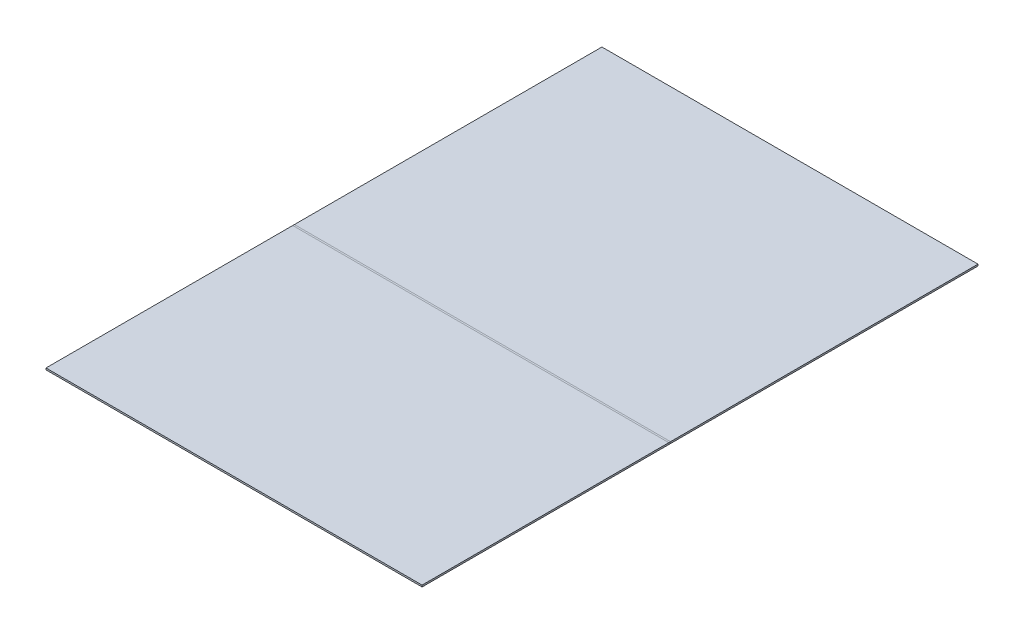
ISO-10303-21;
HEADER;
FILE_DESCRIPTION(('STEP AP214'),'2;1');
FILE_NAME('part.step','',(''),(''),'','','');
FILE_SCHEMA(('AUTOMOTIVE_DESIGN { 1 0 10303 214 1 1 1 1 }'));
ENDSEC;
DATA;
#1=APPLICATION_CONTEXT('core data for automotive mechanical design processes');
#2=APPLICATION_PROTOCOL_DEFINITION('international standard','automotive_design',2000,#1);
#3=PRODUCT_CONTEXT('',#1,'mechanical');
#4=PRODUCT('Part','Part','',(#3));
#5=PRODUCT_RELATED_PRODUCT_CATEGORY('part','',(#4));
#6=PRODUCT_DEFINITION_FORMATION('','',#4);
#7=PRODUCT_DEFINITION_CONTEXT('part definition',#1,'design');
#8=PRODUCT_DEFINITION('design','',#6,#7);
#9=PRODUCT_DEFINITION_SHAPE('','',#8);
#10=(LENGTH_UNIT() NAMED_UNIT(*) SI_UNIT(.MILLI.,.METRE.));
#11=(NAMED_UNIT(*) PLANE_ANGLE_UNIT() SI_UNIT($,.RADIAN.));
#12=(NAMED_UNIT(*) SI_UNIT($,.STERADIAN.) SOLID_ANGLE_UNIT());
#13=UNCERTAINTY_MEASURE_WITH_UNIT(LENGTH_MEASURE(1.E-05),#10,'distance_accuracy_value','');
#14=(GEOMETRIC_REPRESENTATION_CONTEXT(3) GLOBAL_UNCERTAINTY_ASSIGNED_CONTEXT((#13)) GLOBAL_UNIT_ASSIGNED_CONTEXT((#10,
#11,#12)) REPRESENTATION_CONTEXT('',''));
#15=CARTESIAN_POINT('',(0.,0.,0.));
#16=DIRECTION('',(0.,0.,1.));
#17=DIRECTION('',(1.,0.,0.));
#18=AXIS2_PLACEMENT_3D('',#15,#16,#17);
#19=CARTESIAN_POINT('',(0.,1.9557999999999,291.722844699422));
#20=DIRECTION('',(1.,0.,0.));
#21=DIRECTION('',(0.,0.86602540378444,-0.499999999999997));
#22=AXIS2_PLACEMENT_3D('',#19,#20,#21);
#23=PLANE('',#22);
#24=DIRECTION('',(0.,0.,1.));
#25=VECTOR('',#24,1.);
#26=CARTESIAN_POINT('',(0.,0.,291.018939251226));
#27=LINE('',#26,#25);
#28=CARTESIAN_POINT('',(0.,0.,292.36075901185));
#29=VERTEX_POINT('',#28);
#30=CARTESIAN_POINT('',(0.,-3.88578058618805E-13,525.65408864989));
#31=VERTEX_POINT('',#30);
#32=EDGE_CURVE('E66',#29,#31,#27,.T.);
#33=ORIENTED_EDGE('',*,*,#32,.F.);
#34=DIRECTION('',(0.,1.,0.));
#35=VECTOR('',#34,1.);
#36=CARTESIAN_POINT('',(0.,0.,292.36075901185));
#37=LINE('',#36,#35);
#38=CARTESIAN_POINT('',(0.,1.58749999999996,292.36075901185));
#39=VERTEX_POINT('',#38);
#40=EDGE_CURVE('E11',#29,#39,#37,.T.);
#41=ORIENTED_EDGE('',*,*,#40,.T.);
#42=DIRECTION('',(0.,0.,1.));
#43=VECTOR('',#42,1.);
#44=CARTESIAN_POINT('',(0.,1.58749999999991,291.018939251226));
#45=LINE('',#44,#43);
#46=CARTESIAN_POINT('',(0.,1.58749999999958,525.65408864989));
#47=VERTEX_POINT('',#46);
#48=EDGE_CURVE('E109',#39,#47,#45,.T.);
#49=ORIENTED_EDGE('',*,*,#48,.T.);
#50=DIRECTION('',(0.,1.,0.));
#51=VECTOR('',#50,1.);
#52=CARTESIAN_POINT('',(0.,-3.88578058618805E-13,525.65408864989));
#53=LINE('',#52,#51);
#54=EDGE_CURVE('E103',#31,#47,#53,.T.);
#55=ORIENTED_EDGE('',*,*,#54,.F.);
#56=EDGE_LOOP('',(#33,#41,#49,#55));
#57=FACE_BOUND('',#56,.T.);
#58=ADVANCED_FACE('F37',(#57),#23,.T.);
#59=CARTESIAN_POINT('',(-355.6,1.58749999999991,291.018939251226));
#60=DIRECTION('',(0.,1.,0.));
#61=DIRECTION('',(0.,0.,1.));
#62=AXIS2_PLACEMENT_3D('',#59,#60,#61);
#63=PLANE('',#62);
#64=ORIENTED_EDGE('',*,*,#48,.F.);
#65=DIRECTION('',(1.,0.,0.));
#66=VECTOR('',#65,1.);
#67=CARTESIAN_POINT('',(-355.6,1.58749999999991,292.36075901185));
#68=LINE('',#67,#66);
#69=CARTESIAN_POINT('',(-355.6,1.58749999999996,292.36075901185));
#70=VERTEX_POINT('',#69);
#71=EDGE_CURVE('E45',#70,#39,#68,.T.);
#72=ORIENTED_EDGE('',*,*,#71,.F.);
#73=DIRECTION('',(0.,0.,1.));
#74=VECTOR('',#73,1.);
#75=CARTESIAN_POINT('',(-355.6,1.58749999999991,291.018939251226));
#76=LINE('',#75,#74);
#77=CARTESIAN_POINT('',(-355.6,1.58749999999958,525.65408864989));
#78=VERTEX_POINT('',#77);
#79=EDGE_CURVE('E104',#70,#78,#76,.T.);
#80=ORIENTED_EDGE('',*,*,#79,.T.);
#81=DIRECTION('',(1.,0.,0.));
#82=VECTOR('',#81,1.);
#83=CARTESIAN_POINT('',(-355.6,1.58749999999958,525.65408864989));
#84=LINE('',#83,#82);
#85=EDGE_CURVE('E114',#78,#47,#84,.T.);
#86=ORIENTED_EDGE('',*,*,#85,.T.);
#87=EDGE_LOOP('',(#64,#72,#80,#86));
#88=FACE_BOUND('',#87,.T.);
#89=ADVANCED_FACE('F129',(#88),#63,.T.);
#90=CARTESIAN_POINT('',(-355.6,0.,291.018939251226));
#91=DIRECTION('',(0.,1.,0.));
#92=DIRECTION('',(0.,0.,1.));
#93=AXIS2_PLACEMENT_3D('',#90,#91,#92);
#94=PLANE('',#93);
#95=ORIENTED_EDGE('',*,*,#32,.T.);
#96=DIRECTION('',(1.,0.,0.));
#97=VECTOR('',#96,1.);
#98=CARTESIAN_POINT('',(-355.6,-3.88578058618805E-13,525.65408864989));
#99=LINE('',#98,#97);
#100=CARTESIAN_POINT('',(-355.6,-3.88578058618805E-13,525.65408864989));
#101=VERTEX_POINT('',#100);
#102=EDGE_CURVE('E99',#101,#31,#99,.T.);
#103=ORIENTED_EDGE('',*,*,#102,.F.);
#104=DIRECTION('',(0.,0.,1.));
#105=VECTOR('',#104,1.);
#106=CARTESIAN_POINT('',(-355.6,0.,291.018939251226));
#107=LINE('',#106,#105);
#108=CARTESIAN_POINT('',(-355.6,0.,292.36075901185));
#109=VERTEX_POINT('',#108);
#110=EDGE_CURVE('E53',#109,#101,#107,.T.);
#111=ORIENTED_EDGE('',*,*,#110,.F.);
#112=DIRECTION('',(1.,0.,0.));
#113=VECTOR('',#112,1.);
#114=CARTESIAN_POINT('',(-355.6,0.,292.36075901185));
#115=LINE('',#114,#113);
#116=EDGE_CURVE('E78',#109,#29,#115,.T.);
#117=ORIENTED_EDGE('',*,*,#116,.T.);
#118=EDGE_LOOP('',(#95,#103,#111,#117));
#119=FACE_BOUND('',#118,.T.);
#120=ADVANCED_FACE('F97',(#119),#94,.F.);
#121=CARTESIAN_POINT('',(-355.6,-3.88578058618805E-13,525.65408864989));
#122=DIRECTION('',(0.,0.,-1.));
#123=DIRECTION('',(0.,1.,0.));
#124=AXIS2_PLACEMENT_3D('',#121,#122,#123);
#125=PLANE('',#124);
#126=ORIENTED_EDGE('',*,*,#54,.T.);
#127=ORIENTED_EDGE('',*,*,#85,.F.);
#128=DIRECTION('',(0.,1.,0.));
#129=VECTOR('',#128,1.);
#130=CARTESIAN_POINT('',(-355.6,-3.88578058618805E-13,525.65408864989));
#131=LINE('',#130,#129);
#132=EDGE_CURVE('E107',#101,#78,#131,.T.);
#133=ORIENTED_EDGE('',*,*,#132,.F.);
#134=ORIENTED_EDGE('',*,*,#102,.T.);
#135=EDGE_LOOP('',(#126,#127,#133,#134));
#136=FACE_BOUND('',#135,.T.);
#137=ADVANCED_FACE('F218',(#136),#125,.F.);
#138=CARTESIAN_POINT('',(-355.6,2.32409999999988,292.36075901185));
#139=DIRECTION('',(1.,0.,0.));
#140=DIRECTION('',(0.,0.86602540378444,-0.499999999999997));
#141=AXIS2_PLACEMENT_3D('',#138,#139,#140);
#142=PLANE('',#141);
#143=ORIENTED_EDGE('',*,*,#79,.F.);
#144=DIRECTION('',(0.,-1.,0.));
#145=VECTOR('',#144,1.);
#146=CARTESIAN_POINT('',(-355.6,1.58749999999991,292.36075901185));
#147=LINE('',#146,#145);
#148=EDGE_CURVE('E98',#70,#109,#147,.T.);
#149=ORIENTED_EDGE('',*,*,#148,.T.);
#150=ORIENTED_EDGE('',*,*,#110,.T.);
#151=ORIENTED_EDGE('',*,*,#132,.T.);
#152=EDGE_LOOP('',(#143,#149,#150,#151));
#153=FACE_BOUND('',#152,.T.);
#154=ADVANCED_FACE('F222',(#153),#142,.F.);
#155=CARTESIAN_POINT('',(-355.6,1.5875,0.));
#156=DIRECTION('',(0.,0.,1.));
#157=DIRECTION('',(0.,-1.,0.));
#158=AXIS2_PLACEMENT_3D('',#155,#156,#157);
#159=PLANE('',#158);
#160=DIRECTION('',(0.,-1.,0.));
#161=VECTOR('',#160,1.);
#162=CARTESIAN_POINT('',(0.,1.5875,0.));
#163=LINE('',#162,#161);
#164=CARTESIAN_POINT('',(0.,1.5875,0.));
#165=VERTEX_POINT('',#164);
#166=CARTESIAN_POINT('',(0.,0.,0.));
#167=VERTEX_POINT('',#166);
#168=EDGE_CURVE('E176',#165,#167,#163,.T.);
#169=ORIENTED_EDGE('',*,*,#168,.T.);
#170=DIRECTION('',(1.,0.,0.));
#171=VECTOR('',#170,1.);
#172=CARTESIAN_POINT('',(-355.6,0.,0.));
#173=LINE('',#172,#171);
#174=CARTESIAN_POINT('',(-355.6,0.,0.));
#175=VERTEX_POINT('',#174);
#176=EDGE_CURVE('E170',#175,#167,#173,.T.);
#177=ORIENTED_EDGE('',*,*,#176,.F.);
#178=DIRECTION('',(0.,-1.,0.));
#179=VECTOR('',#178,1.);
#180=CARTESIAN_POINT('',(-355.6,1.5875,0.));
#181=LINE('',#180,#179);
#182=CARTESIAN_POINT('',(-355.6,1.5875,0.));
#183=VERTEX_POINT('',#182);
#184=EDGE_CURVE('E160',#183,#175,#181,.T.);
#185=ORIENTED_EDGE('',*,*,#184,.F.);
#186=DIRECTION('',(1.,0.,0.));
#187=VECTOR('',#186,1.);
#188=CARTESIAN_POINT('',(-355.6,1.5875,0.));
#189=LINE('',#188,#187);
#190=EDGE_CURVE('E178',#183,#165,#189,.T.);
#191=ORIENTED_EDGE('',*,*,#190,.T.);
#192=EDGE_LOOP('',(#169,#177,#185,#191));
#193=FACE_BOUND('',#192,.T.);
#194=ADVANCED_FACE('F198',(#193),#159,.F.);
#195=CARTESIAN_POINT('',(-355.6,0.,0.));
#196=DIRECTION('',(0.,1.,0.));
#197=DIRECTION('',(0.,0.,1.));
#198=AXIS2_PLACEMENT_3D('',#195,#196,#197);
#199=PLANE('',#198);
#200=DIRECTION('',(0.,0.,1.));
#201=VECTOR('',#200,1.);
#202=CARTESIAN_POINT('',(0.,0.,0.));
#203=LINE('',#202,#201);
#204=CARTESIAN_POINT('',(0.,0.,290.758180239376));
#205=VERTEX_POINT('',#204);
#206=EDGE_CURVE('E174',#167,#205,#203,.T.);
#207=ORIENTED_EDGE('',*,*,#206,.T.);
#208=DIRECTION('',(1.,0.,0.));
#209=VECTOR('',#208,1.);
#210=CARTESIAN_POINT('',(-355.6,0.,290.758180239376));
#211=LINE('',#210,#209);
#212=CARTESIAN_POINT('',(-355.6,0.,290.758180239376));
#213=VERTEX_POINT('',#212);
#214=EDGE_CURVE('E82',#213,#205,#211,.T.);
#215=ORIENTED_EDGE('',*,*,#214,.F.);
#216=DIRECTION('',(0.,0.,1.));
#217=VECTOR('',#216,1.);
#218=CARTESIAN_POINT('',(-355.6,0.,0.));
#219=LINE('',#218,#217);
#220=EDGE_CURVE('E161',#175,#213,#219,.T.);
#221=ORIENTED_EDGE('',*,*,#220,.F.);
#222=ORIENTED_EDGE('',*,*,#176,.T.);
#223=EDGE_LOOP('',(#207,#215,#221,#222));
#224=FACE_BOUND('',#223,.T.);
#225=ADVANCED_FACE('F172',(#224),#199,.F.);
#226=CARTESIAN_POINT('',(-355.6,1.95579999999998,291.396094551804));
#227=DIRECTION('',(-1.,0.,0.));
#228=DIRECTION('',(0.,0.,1.));
#229=AXIS2_PLACEMENT_3D('',#226,#227,#228);
#230=PLANE('',#229);
#231=ORIENTED_EDGE('',*,*,#220,.T.);
#232=DIRECTION('',(0.,1.,0.));
#233=VECTOR('',#232,1.);
#234=CARTESIAN_POINT('',(-355.6,0.,290.758180239376));
#235=LINE('',#234,#233);
#236=CARTESIAN_POINT('',(-355.6,1.58749999999996,290.758180239376));
#237=VERTEX_POINT('',#236);
#238=EDGE_CURVE('E154',#213,#237,#235,.T.);
#239=ORIENTED_EDGE('',*,*,#238,.T.);
#240=DIRECTION('',(0.,0.,1.));
#241=VECTOR('',#240,1.);
#242=CARTESIAN_POINT('',(-355.6,1.5875,0.));
#243=LINE('',#242,#241);
#244=EDGE_CURVE('E192',#183,#237,#243,.T.);
#245=ORIENTED_EDGE('',*,*,#244,.F.);
#246=ORIENTED_EDGE('',*,*,#184,.T.);
#247=EDGE_LOOP('',(#231,#239,#245,#246));
#248=FACE_BOUND('',#247,.T.);
#249=ADVANCED_FACE('F165',(#248),#230,.T.);
#250=CARTESIAN_POINT('',(-355.6,1.5875,0.));
#251=DIRECTION('',(0.,1.,0.));
#252=DIRECTION('',(0.,0.,1.));
#253=AXIS2_PLACEMENT_3D('',#250,#251,#252);
#254=PLANE('',#253);
#255=DIRECTION('',(0.,0.,1.));
#256=VECTOR('',#255,1.);
#257=CARTESIAN_POINT('',(0.,1.5875,0.));
#258=LINE('',#257,#256);
#259=CARTESIAN_POINT('',(0.,1.58749999999996,290.758180239376));
#260=VERTEX_POINT('',#259);
#261=EDGE_CURVE('E184',#165,#260,#258,.T.);
#262=ORIENTED_EDGE('',*,*,#261,.F.);
#263=ORIENTED_EDGE('',*,*,#190,.F.);
#264=ORIENTED_EDGE('',*,*,#244,.T.);
#265=DIRECTION('',(1.,0.,0.));
#266=VECTOR('',#265,1.);
#267=CARTESIAN_POINT('',(-355.6,1.58749999999996,290.758180239376));
#268=LINE('',#267,#266);
#269=EDGE_CURVE('E151',#237,#260,#268,.T.);
#270=ORIENTED_EDGE('',*,*,#269,.T.);
#271=EDGE_LOOP('',(#262,#263,#264,#270));
#272=FACE_BOUND('',#271,.T.);
#273=ADVANCED_FACE('F202',(#272),#254,.T.);
#274=CARTESIAN_POINT('',(0.,2.32409999999996,290.758180239376));
#275=DIRECTION('',(1.,0.,0.));
#276=DIRECTION('',(0.,0.,-1.));
#277=AXIS2_PLACEMENT_3D('',#274,#275,#276);
#278=PLANE('',#277);
#279=ORIENTED_EDGE('',*,*,#261,.T.);
#280=DIRECTION('',(0.,-1.,0.));
#281=VECTOR('',#280,1.);
#282=CARTESIAN_POINT('',(0.,1.58749999999996,290.758180239376));
#283=LINE('',#282,#281);
#284=EDGE_CURVE('E183',#260,#205,#283,.T.);
#285=ORIENTED_EDGE('',*,*,#284,.T.);
#286=ORIENTED_EDGE('',*,*,#206,.F.);
#287=ORIENTED_EDGE('',*,*,#168,.F.);
#288=EDGE_LOOP('',(#279,#285,#286,#287));
#289=FACE_BOUND('',#288,.T.);
#290=ADVANCED_FACE('F201',(#289),#278,.T.);
#291=CARTESIAN_POINT('',(0.,0.,290.758180239376));
#292=DIRECTION('',(1.,0.,0.));
#293=DIRECTION('',(0.,0.,1.));
#294=AXIS2_PLACEMENT_3D('',#291,#292,#293);
#295=PLANE('',#294);
#296=ORIENTED_EDGE('',*,*,#284,.F.);
#297=DIRECTION('',(0.,0.,-1.));
#298=VECTOR('',#297,1.);
#299=CARTESIAN_POINT('',(0.,1.58749999999996,291.559469625613));
#300=LINE('',#299,#298);
#301=EDGE_CURVE('E93',#260,#39,#300,.F.);
#302=ORIENTED_EDGE('',*,*,#301,.T.);
#303=ORIENTED_EDGE('',*,*,#40,.F.);
#304=DIRECTION('',(0.,0.,1.));
#305=VECTOR('',#304,1.);
#306=CARTESIAN_POINT('',(0.,0.,290.758180239376));
#307=LINE('',#306,#305);
#308=EDGE_CURVE('E73',#205,#29,#307,.T.);
#309=ORIENTED_EDGE('',*,*,#308,.F.);
#310=EDGE_LOOP('',(#296,#302,#303,#309));
#311=FACE_BOUND('',#310,.T.);
#312=ADVANCED_FACE('F90',(#311),#295,.T.);
#313=CARTESIAN_POINT('',(-355.6,0.,290.758180239376));
#314=DIRECTION('',(-1.,0.,0.));
#315=DIRECTION('',(0.,0.,-1.));
#316=AXIS2_PLACEMENT_3D('',#313,#314,#315);
#317=PLANE('',#316);
#318=ORIENTED_EDGE('',*,*,#148,.F.);
#319=DIRECTION('',(0.,0.,-1.));
#320=VECTOR('',#319,1.);
#321=CARTESIAN_POINT('',(-355.6,1.58749999999996,291.559469625613));
#322=LINE('',#321,#320);
#323=EDGE_CURVE('E87',#70,#237,#322,.T.);
#324=ORIENTED_EDGE('',*,*,#323,.T.);
#325=ORIENTED_EDGE('',*,*,#238,.F.);
#326=DIRECTION('',(0.,0.,-1.));
#327=VECTOR('',#326,1.);
#328=CARTESIAN_POINT('',(-355.6,0.,290.758180239376));
#329=LINE('',#328,#327);
#330=EDGE_CURVE('E86',#109,#213,#329,.T.);
#331=ORIENTED_EDGE('',*,*,#330,.F.);
#332=EDGE_LOOP('',(#318,#324,#325,#331));
#333=FACE_BOUND('',#332,.T.);
#334=ADVANCED_FACE('F155',(#333),#317,.T.);
#335=CARTESIAN_POINT('',(-177.8,0.,291.559469625613));
#336=DIRECTION('',(0.,-1.,0.));
#337=DIRECTION('',(0.,0.,-1.));
#338=AXIS2_PLACEMENT_3D('',#335,#336,#337);
#339=PLANE('',#338);
#340=ORIENTED_EDGE('',*,*,#330,.T.);
#341=ORIENTED_EDGE('',*,*,#214,.T.);
#342=ORIENTED_EDGE('',*,*,#308,.T.);
#343=ORIENTED_EDGE('',*,*,#116,.F.);
#344=EDGE_LOOP('',(#340,#341,#342,#343));
#345=FACE_BOUND('',#344,.T.);
#346=ADVANCED_FACE('F76',(#345),#339,.T.);
#347=CARTESIAN_POINT('',(-177.8,1.58749999999996,291.559469625613));
#348=DIRECTION('',(0.,-1.,0.));
#349=DIRECTION('',(0.,0.,-1.));
#350=AXIS2_PLACEMENT_3D('',#347,#348,#349);
#351=PLANE('',#350);
#352=ORIENTED_EDGE('',*,*,#323,.F.);
#353=ORIENTED_EDGE('',*,*,#71,.T.);
#354=ORIENTED_EDGE('',*,*,#301,.F.);
#355=ORIENTED_EDGE('',*,*,#269,.F.);
#356=EDGE_LOOP('',(#352,#353,#354,#355));
#357=FACE_BOUND('',#356,.T.);
#358=ADVANCED_FACE('F120',(#357),#351,.F.);
#359=CLOSED_SHELL('',(#58,#89,#120,#137,#154,#194,#225,#249,#273,#290,#312,#334,#346,#358));
#360=MANIFOLD_SOLID_BREP('B2',#359);
#361=ADVANCED_BREP_SHAPE_REPRESENTATION('',(#18,#360),#14);
#362=SHAPE_DEFINITION_REPRESENTATION(#9,#361);
ENDSEC;
END-ISO-10303-21;
